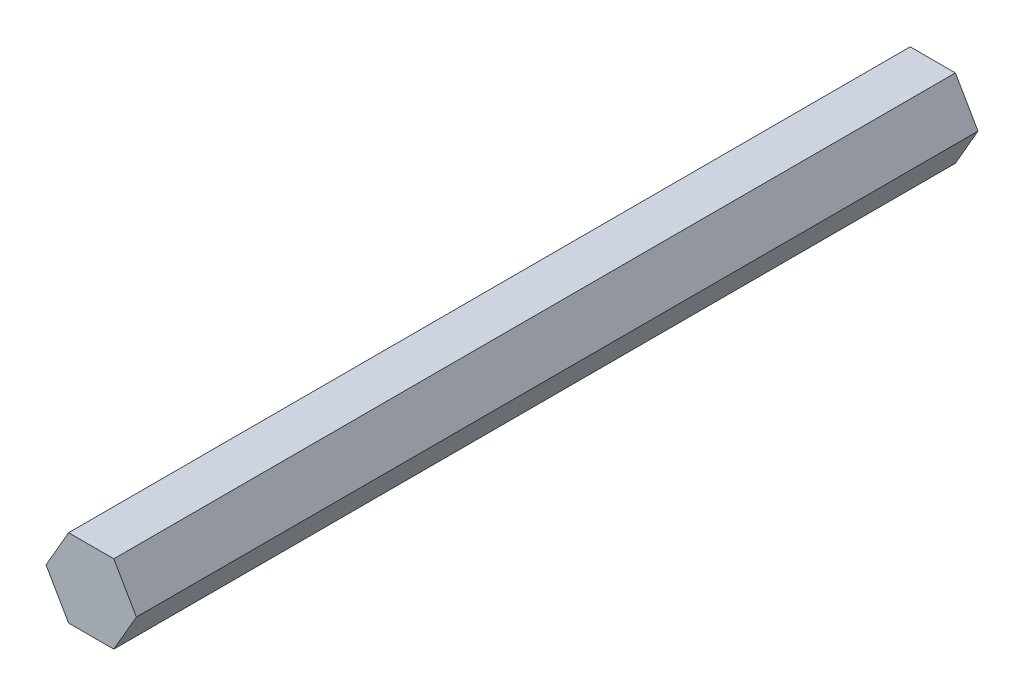
ISO-10303-21;
HEADER;
FILE_DESCRIPTION(('STEP AP214'),'2;1');
FILE_NAME('part.step','',(''),(''),'','','');
FILE_SCHEMA(('AUTOMOTIVE_DESIGN { 1 0 10303 214 1 1 1 1 }'));
ENDSEC;
DATA;
#1=APPLICATION_CONTEXT('core data for automotive mechanical design processes');
#2=APPLICATION_PROTOCOL_DEFINITION('international standard','automotive_design',2000,#1);
#3=PRODUCT_CONTEXT('',#1,'mechanical');
#4=PRODUCT('Part','Part','',(#3));
#5=PRODUCT_RELATED_PRODUCT_CATEGORY('part','',(#4));
#6=PRODUCT_DEFINITION_FORMATION('','',#4);
#7=PRODUCT_DEFINITION_CONTEXT('part definition',#1,'design');
#8=PRODUCT_DEFINITION('design','',#6,#7);
#9=PRODUCT_DEFINITION_SHAPE('','',#8);
#10=(LENGTH_UNIT() NAMED_UNIT(*) SI_UNIT(.MILLI.,.METRE.));
#11=(NAMED_UNIT(*) PLANE_ANGLE_UNIT() SI_UNIT($,.RADIAN.));
#12=(NAMED_UNIT(*) SI_UNIT($,.STERADIAN.) SOLID_ANGLE_UNIT());
#13=UNCERTAINTY_MEASURE_WITH_UNIT(LENGTH_MEASURE(1.E-05),#10,'distance_accuracy_value','');
#14=(GEOMETRIC_REPRESENTATION_CONTEXT(3) GLOBAL_UNCERTAINTY_ASSIGNED_CONTEXT((#13)) GLOBAL_UNIT_ASSIGNED_CONTEXT((#10,
#11,#12)) REPRESENTATION_CONTEXT('',''));
#15=CARTESIAN_POINT('',(0.,0.,0.));
#16=DIRECTION('',(0.,0.,1.));
#17=DIRECTION('',(1.,0.,0.));
#18=AXIS2_PLACEMENT_3D('',#15,#16,#17);
#19=CARTESIAN_POINT('',(7.33234841870825,0.,136.525));
#20=DIRECTION('',(-0.866025403784439,-0.5,0.));
#21=DIRECTION('',(0.5,-0.866025403784439,0.));
#22=AXIS2_PLACEMENT_3D('',#19,#20,#21);
#23=PLANE('',#22);
#24=DIRECTION('',(-0.5,0.866025403784439,0.));
#25=VECTOR('',#24,1.);
#26=CARTESIAN_POINT('',(7.33234841870825,0.,0.));
#27=LINE('',#26,#25);
#28=CARTESIAN_POINT('',(7.33234841870825,0.,0.));
#29=VERTEX_POINT('',#28);
#30=CARTESIAN_POINT('',(3.66617420935412,6.35,0.));
#31=VERTEX_POINT('',#30);
#32=EDGE_CURVE('E135',#29,#31,#27,.T.);
#33=ORIENTED_EDGE('',*,*,#32,.T.);
#34=DIRECTION('',(0.,0.,-1.));
#35=VECTOR('',#34,1.);
#36=CARTESIAN_POINT('',(3.66617420935412,6.35,136.525));
#37=LINE('',#36,#35);
#38=CARTESIAN_POINT('',(3.66617420935412,6.35,136.525));
#39=VERTEX_POINT('',#38);
#40=EDGE_CURVE('E11',#39,#31,#37,.T.);
#41=ORIENTED_EDGE('',*,*,#40,.F.);
#42=DIRECTION('',(-0.5,0.866025403784439,0.));
#43=VECTOR('',#42,1.);
#44=CARTESIAN_POINT('',(7.33234841870825,0.,136.525));
#45=LINE('',#44,#43);
#46=CARTESIAN_POINT('',(7.33234841870825,0.,136.525));
#47=VERTEX_POINT('',#46);
#48=EDGE_CURVE('E146',#47,#39,#45,.T.);
#49=ORIENTED_EDGE('',*,*,#48,.F.);
#50=DIRECTION('',(0.,0.,-1.));
#51=VECTOR('',#50,1.);
#52=CARTESIAN_POINT('',(7.33234841870825,0.,136.525));
#53=LINE('',#52,#51);
#54=EDGE_CURVE('E131',#47,#29,#53,.T.);
#55=ORIENTED_EDGE('',*,*,#54,.T.);
#56=EDGE_LOOP('',(#33,#41,#49,#55));
#57=FACE_BOUND('',#56,.T.);
#58=ADVANCED_FACE('F49',(#57),#23,.F.);
#59=CARTESIAN_POINT('',(3.66617420935412,6.35,136.525));
#60=DIRECTION('',(0.,-1.,0.));
#61=DIRECTION('',(0.,0.,-1.));
#62=AXIS2_PLACEMENT_3D('',#59,#60,#61);
#63=PLANE('',#62);
#64=DIRECTION('',(-1.,0.,0.));
#65=VECTOR('',#64,1.);
#66=CARTESIAN_POINT('',(3.66617420935412,6.35,0.));
#67=LINE('',#66,#65);
#68=CARTESIAN_POINT('',(-3.66617420935412,6.35,0.));
#69=VERTEX_POINT('',#68);
#70=EDGE_CURVE('E138',#31,#69,#67,.T.);
#71=ORIENTED_EDGE('',*,*,#70,.T.);
#72=DIRECTION('',(0.,0.,-1.));
#73=VECTOR('',#72,1.);
#74=CARTESIAN_POINT('',(-3.66617420935412,6.35,136.525));
#75=LINE('',#74,#73);
#76=CARTESIAN_POINT('',(-3.66617420935412,6.35,136.525));
#77=VERTEX_POINT('',#76);
#78=EDGE_CURVE('E57',#77,#69,#75,.T.);
#79=ORIENTED_EDGE('',*,*,#78,.F.);
#80=DIRECTION('',(-1.,0.,0.));
#81=VECTOR('',#80,1.);
#82=CARTESIAN_POINT('',(3.66617420935412,6.35,136.525));
#83=LINE('',#82,#81);
#84=EDGE_CURVE('E103',#39,#77,#83,.T.);
#85=ORIENTED_EDGE('',*,*,#84,.F.);
#86=ORIENTED_EDGE('',*,*,#40,.T.);
#87=EDGE_LOOP('',(#71,#79,#85,#86));
#88=FACE_BOUND('',#87,.T.);
#89=ADVANCED_FACE('F170',(#88),#63,.F.);
#90=CARTESIAN_POINT('',(-3.66617420935412,6.35,136.525));
#91=DIRECTION('',(0.866025403784439,-0.5,0.));
#92=DIRECTION('',(0.5,0.866025403784439,0.));
#93=AXIS2_PLACEMENT_3D('',#90,#91,#92);
#94=PLANE('',#93);
#95=DIRECTION('',(-0.5,-0.866025403784439,0.));
#96=VECTOR('',#95,1.);
#97=CARTESIAN_POINT('',(-3.66617420935412,6.35,0.));
#98=LINE('',#97,#96);
#99=CARTESIAN_POINT('',(-7.33234841870824,0.,0.));
#100=VERTEX_POINT('',#99);
#101=EDGE_CURVE('E141',#69,#100,#98,.T.);
#102=ORIENTED_EDGE('',*,*,#101,.T.);
#103=DIRECTION('',(0.,0.,-1.));
#104=VECTOR('',#103,1.);
#105=CARTESIAN_POINT('',(-7.33234841870824,0.,136.525));
#106=LINE('',#105,#104);
#107=CARTESIAN_POINT('',(-7.33234841870824,0.,136.525));
#108=VERTEX_POINT('',#107);
#109=EDGE_CURVE('E126',#108,#100,#106,.T.);
#110=ORIENTED_EDGE('',*,*,#109,.F.);
#111=DIRECTION('',(-0.5,-0.866025403784439,0.));
#112=VECTOR('',#111,1.);
#113=CARTESIAN_POINT('',(-3.66617420935412,6.35,136.525));
#114=LINE('',#113,#112);
#115=EDGE_CURVE('E117',#77,#108,#114,.T.);
#116=ORIENTED_EDGE('',*,*,#115,.F.);
#117=ORIENTED_EDGE('',*,*,#78,.T.);
#118=EDGE_LOOP('',(#102,#110,#116,#117));
#119=FACE_BOUND('',#118,.T.);
#120=ADVANCED_FACE('F152',(#119),#94,.F.);
#121=CARTESIAN_POINT('',(-7.33234841870824,0.,136.525));
#122=DIRECTION('',(0.866025403784439,0.5,0.));
#123=DIRECTION('',(-0.5,0.866025403784439,0.));
#124=AXIS2_PLACEMENT_3D('',#121,#122,#123);
#125=PLANE('',#124);
#126=DIRECTION('',(0.5,-0.866025403784439,0.));
#127=VECTOR('',#126,1.);
#128=CARTESIAN_POINT('',(-7.33234841870824,0.,0.));
#129=LINE('',#128,#127);
#130=CARTESIAN_POINT('',(-3.66617420935412,-6.35,0.));
#131=VERTEX_POINT('',#130);
#132=EDGE_CURVE('E125',#100,#131,#129,.T.);
#133=ORIENTED_EDGE('',*,*,#132,.T.);
#134=DIRECTION('',(0.,0.,-1.));
#135=VECTOR('',#134,1.);
#136=CARTESIAN_POINT('',(-3.66617420935412,-6.35,136.525));
#137=LINE('',#136,#135);
#138=CARTESIAN_POINT('',(-3.66617420935412,-6.35,136.525));
#139=VERTEX_POINT('',#138);
#140=EDGE_CURVE('E122',#139,#131,#137,.T.);
#141=ORIENTED_EDGE('',*,*,#140,.F.);
#142=DIRECTION('',(0.5,-0.866025403784439,0.));
#143=VECTOR('',#142,1.);
#144=CARTESIAN_POINT('',(-7.33234841870824,0.,136.525));
#145=LINE('',#144,#143);
#146=EDGE_CURVE('E111',#108,#139,#145,.T.);
#147=ORIENTED_EDGE('',*,*,#146,.F.);
#148=ORIENTED_EDGE('',*,*,#109,.T.);
#149=EDGE_LOOP('',(#133,#141,#147,#148));
#150=FACE_BOUND('',#149,.T.);
#151=ADVANCED_FACE('F123',(#150),#125,.F.);
#152=CARTESIAN_POINT('',(-3.66617420935412,-6.35,136.525));
#153=DIRECTION('',(0.,1.,0.));
#154=DIRECTION('',(0.,0.,1.));
#155=AXIS2_PLACEMENT_3D('',#152,#153,#154);
#156=PLANE('',#155);
#157=DIRECTION('',(1.,0.,0.));
#158=VECTOR('',#157,1.);
#159=CARTESIAN_POINT('',(-3.66617420935412,-6.35,0.));
#160=LINE('',#159,#158);
#161=CARTESIAN_POINT('',(3.66617420935412,-6.35,0.));
#162=VERTEX_POINT('',#161);
#163=EDGE_CURVE('E89',#131,#162,#160,.T.);
#164=ORIENTED_EDGE('',*,*,#163,.T.);
#165=DIRECTION('',(0.,0.,-1.));
#166=VECTOR('',#165,1.);
#167=CARTESIAN_POINT('',(3.66617420935412,-6.35,136.525));
#168=LINE('',#167,#166);
#169=CARTESIAN_POINT('',(3.66617420935412,-6.35,136.525));
#170=VERTEX_POINT('',#169);
#171=EDGE_CURVE('E127',#170,#162,#168,.T.);
#172=ORIENTED_EDGE('',*,*,#171,.F.);
#173=DIRECTION('',(1.,0.,0.));
#174=VECTOR('',#173,1.);
#175=CARTESIAN_POINT('',(-3.66617420935412,-6.35,136.525));
#176=LINE('',#175,#174);
#177=EDGE_CURVE('E115',#139,#170,#176,.T.);
#178=ORIENTED_EDGE('',*,*,#177,.F.);
#179=ORIENTED_EDGE('',*,*,#140,.T.);
#180=EDGE_LOOP('',(#164,#172,#178,#179));
#181=FACE_BOUND('',#180,.T.);
#182=ADVANCED_FACE('F129',(#181),#156,.F.);
#183=CARTESIAN_POINT('',(3.66617420935412,-6.35,136.525));
#184=DIRECTION('',(-0.866025403784439,0.5,0.));
#185=DIRECTION('',(-0.5,-0.866025403784439,0.));
#186=AXIS2_PLACEMENT_3D('',#183,#184,#185);
#187=PLANE('',#186);
#188=DIRECTION('',(0.5,0.866025403784439,0.));
#189=VECTOR('',#188,1.);
#190=CARTESIAN_POINT('',(3.66617420935412,-6.35,0.));
#191=LINE('',#190,#189);
#192=EDGE_CURVE('E95',#162,#29,#191,.T.);
#193=ORIENTED_EDGE('',*,*,#192,.T.);
#194=ORIENTED_EDGE('',*,*,#54,.F.);
#195=DIRECTION('',(0.5,0.866025403784439,0.));
#196=VECTOR('',#195,1.);
#197=CARTESIAN_POINT('',(3.66617420935412,-6.35,136.525));
#198=LINE('',#197,#196);
#199=EDGE_CURVE('E65',#170,#47,#198,.T.);
#200=ORIENTED_EDGE('',*,*,#199,.F.);
#201=ORIENTED_EDGE('',*,*,#171,.T.);
#202=EDGE_LOOP('',(#193,#194,#200,#201));
#203=FACE_BOUND('',#202,.T.);
#204=ADVANCED_FACE('F159',(#203),#187,.F.);
#205=CARTESIAN_POINT('',(0.,0.,136.525));
#206=DIRECTION('',(0.,0.,1.));
#207=DIRECTION('',(1.,0.,0.));
#208=AXIS2_PLACEMENT_3D('',#205,#206,#207);
#209=PLANE('',#208);
#210=ORIENTED_EDGE('',*,*,#48,.T.);
#211=ORIENTED_EDGE('',*,*,#84,.T.);
#212=ORIENTED_EDGE('',*,*,#115,.T.);
#213=ORIENTED_EDGE('',*,*,#146,.T.);
#214=ORIENTED_EDGE('',*,*,#177,.T.);
#215=ORIENTED_EDGE('',*,*,#199,.T.);
#216=EDGE_LOOP('',(#210,#211,#212,#213,#214,#215));
#217=FACE_BOUND('',#216,.T.);
#218=ADVANCED_FACE('F113',(#217),#209,.T.);
#219=CARTESIAN_POINT('',(0.,0.,0.));
#220=DIRECTION('',(0.,0.,1.));
#221=DIRECTION('',(1.,0.,0.));
#222=AXIS2_PLACEMENT_3D('',#219,#220,#221);
#223=PLANE('',#222);
#224=CARTESIAN_POINT('',(0.,0.,0.));
#225=DIRECTION('',(0.,0.,-1.));
#226=DIRECTION('',(-1.,0.,0.));
#227=AXIS2_PLACEMENT_3D('',#224,#225,#226);
#228=CIRCLE('',#227,2.01929999999999);
#229=CARTESIAN_POINT('',(-2.01929999999999,0.,0.));
#230=VERTEX_POINT('',#229);
#231=EDGE_CURVE('E248',#230,#230,#228,.T.);
#232=ORIENTED_EDGE('',*,*,#231,.F.);
#233=EDGE_LOOP('',(#232));
#234=FACE_BOUND('',#233,.T.);
#235=ORIENTED_EDGE('',*,*,#32,.F.);
#236=ORIENTED_EDGE('',*,*,#192,.F.);
#237=ORIENTED_EDGE('',*,*,#163,.F.);
#238=ORIENTED_EDGE('',*,*,#132,.F.);
#239=ORIENTED_EDGE('',*,*,#101,.F.);
#240=ORIENTED_EDGE('',*,*,#70,.F.);
#241=EDGE_LOOP('',(#235,#236,#237,#238,#239,#240));
#242=FACE_BOUND('',#241,.T.);
#243=ADVANCED_FACE('F155',(#234,#242),#223,.F.);
#244=CARTESIAN_POINT('',(0.,0.,12.7));
#245=DIRECTION('',(0.,0.,-1.));
#246=DIRECTION('',(-1.,0.,0.));
#247=AXIS2_PLACEMENT_3D('',#244,#245,#246);
#248=CONICAL_SURFACE('',#247,2.01929999999998,1.02974425867665);
#249=CARTESIAN_POINT('',(0.,0.,13.9133178480023));
#250=VERTEX_POINT('',#249);
#251=VERTEX_LOOP('',#250);
#252=FACE_BOUND('',#251,.T.);
#253=CARTESIAN_POINT('',(0.,0.,12.7));
#254=DIRECTION('',(0.,0.,-1.));
#255=DIRECTION('',(-1.,0.,0.));
#256=AXIS2_PLACEMENT_3D('',#253,#254,#255);
#257=CIRCLE('',#256,2.01929999999998);
#258=CARTESIAN_POINT('',(-2.01929999999998,0.,12.7));
#259=VERTEX_POINT('',#258);
#260=EDGE_CURVE('E139',#259,#259,#257,.T.);
#261=ORIENTED_EDGE('',*,*,#260,.T.);
#262=EDGE_LOOP('',(#261));
#263=FACE_BOUND('',#262,.T.);
#264=ADVANCED_FACE('F210',(#252,#263),#248,.F.);
#265=CARTESIAN_POINT('',(0.,0.,0.));
#266=DIRECTION('',(0.,0.,-1.));
#267=DIRECTION('',(-1.,0.,0.));
#268=AXIS2_PLACEMENT_3D('',#265,#266,#267);
#269=CYLINDRICAL_SURFACE('',#268,2.01929999999999);
#270=ORIENTED_EDGE('',*,*,#260,.F.);
#271=EDGE_LOOP('',(#270));
#272=FACE_BOUND('',#271,.T.);
#273=ORIENTED_EDGE('',*,*,#231,.T.);
#274=EDGE_LOOP('',(#273));
#275=FACE_BOUND('',#274,.T.);
#276=ADVANCED_FACE('F220',(#272,#275),#269,.F.);
#277=CLOSED_SHELL('',(#58,#89,#120,#151,#182,#204,#218,#243,#264,#276));
#278=MANIFOLD_SOLID_BREP('B2',#277);
#279=ADVANCED_BREP_SHAPE_REPRESENTATION('',(#18,#278),#14);
#280=SHAPE_DEFINITION_REPRESENTATION(#9,#279);
ENDSEC;
END-ISO-10303-21;
